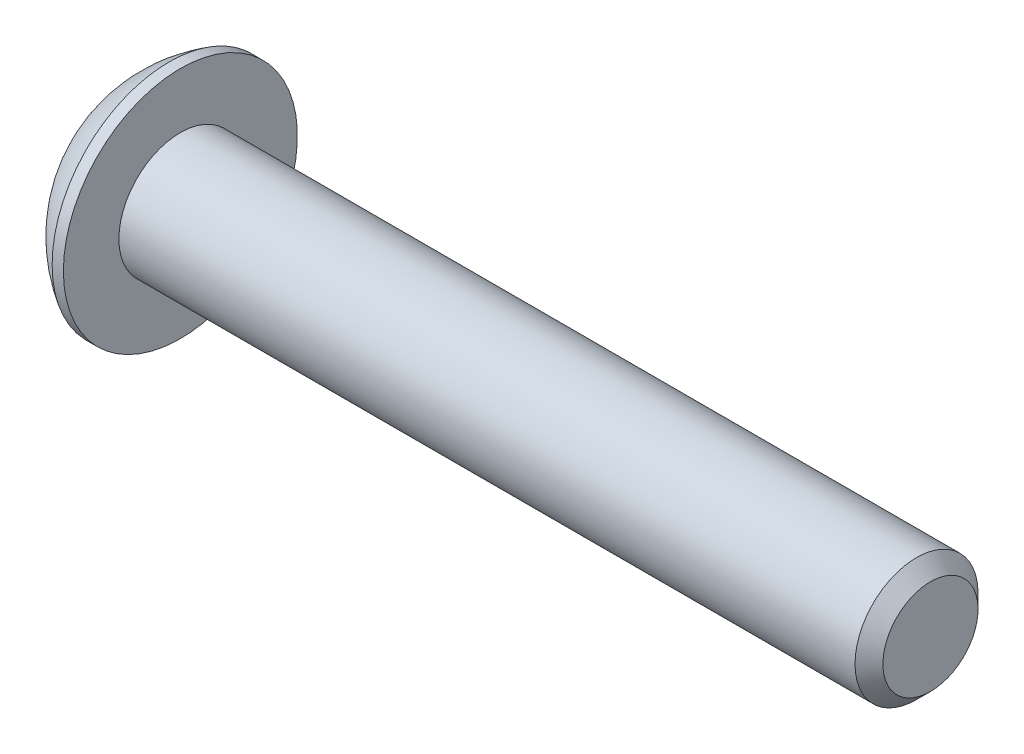
ISO-10303-21;
HEADER;
FILE_DESCRIPTION(('STEP AP214'),'2;1');
FILE_NAME('part.step','',(''),(''),'','','');
FILE_SCHEMA(('AUTOMOTIVE_DESIGN { 1 0 10303 214 1 1 1 1 }'));
ENDSEC;
DATA;
#1=APPLICATION_CONTEXT('core data for automotive mechanical design processes');
#2=APPLICATION_PROTOCOL_DEFINITION('international standard','automotive_design',2000,#1);
#3=PRODUCT_CONTEXT('',#1,'mechanical');
#4=PRODUCT('Part','Part','',(#3));
#5=PRODUCT_RELATED_PRODUCT_CATEGORY('part','',(#4));
#6=PRODUCT_DEFINITION_FORMATION('','',#4);
#7=PRODUCT_DEFINITION_CONTEXT('part definition',#1,'design');
#8=PRODUCT_DEFINITION('design','',#6,#7);
#9=PRODUCT_DEFINITION_SHAPE('','',#8);
#10=(LENGTH_UNIT() NAMED_UNIT(*) SI_UNIT(.MILLI.,.METRE.));
#11=(NAMED_UNIT(*) PLANE_ANGLE_UNIT() SI_UNIT($,.RADIAN.));
#12=(NAMED_UNIT(*) SI_UNIT($,.STERADIAN.) SOLID_ANGLE_UNIT());
#13=UNCERTAINTY_MEASURE_WITH_UNIT(LENGTH_MEASURE(1.E-05),#10,'distance_accuracy_value','');
#14=(GEOMETRIC_REPRESENTATION_CONTEXT(3) GLOBAL_UNCERTAINTY_ASSIGNED_CONTEXT((#13)) GLOBAL_UNIT_ASSIGNED_CONTEXT((#10,
#11,#12)) REPRESENTATION_CONTEXT('',''));
#15=CARTESIAN_POINT('',(0.,0.,0.));
#16=DIRECTION('',(0.,0.,1.));
#17=DIRECTION('',(1.,0.,0.));
#18=AXIS2_PLACEMENT_3D('',#15,#16,#17);
#19=CARTESIAN_POINT('',(1.32080000000034,0.,0.));
#20=DIRECTION('',(-1.,0.,0.));
#21=DIRECTION('',(0.,0.,1.));
#22=AXIS2_PLACEMENT_3D('',#19,#20,#21);
#23=CONICAL_SURFACE('',#22,1.1937999999998,1.04719755119608);
#24=CARTESIAN_POINT('',(2.01004075135902,0.,4.44089209850063E-13));
#25=VERTEX_POINT('',#24);
#26=VERTEX_LOOP('',#25);
#27=FACE_BOUND('',#26,.T.);
#28=CARTESIAN_POINT('',(1.32080000000009,0.,0.));
#29=DIRECTION('',(-1.,0.,0.));
#30=DIRECTION('',(0.,0.,1.));
#31=AXIS2_PLACEMENT_3D('',#28,#29,#30);
#32=CIRCLE('',#31,1.19380000000024);
#33=CARTESIAN_POINT('',(1.32080000000004,-1.03386112703797,0.59690000000006));
#34=VERTEX_POINT('',#33);
#35=CARTESIAN_POINT('',(1.32080000000004,0.,1.19380000000012));
#36=VERTEX_POINT('',#35);
#37=EDGE_CURVE('E18',#34,#36,#32,.T.);
#38=ORIENTED_EDGE('',*,*,#37,.T.);
#39=CARTESIAN_POINT('',(1.32080000000009,0.,0.));
#40=DIRECTION('',(-1.,0.,0.));
#41=DIRECTION('',(0.,0.,1.));
#42=AXIS2_PLACEMENT_3D('',#39,#40,#41);
#43=CIRCLE('',#42,1.19380000000024);
#44=CARTESIAN_POINT('',(1.32080000000004,1.03386112703797,0.596900000000061));
#45=VERTEX_POINT('',#44);
#46=EDGE_CURVE('E139',#36,#45,#43,.T.);
#47=ORIENTED_EDGE('',*,*,#46,.T.);
#48=CARTESIAN_POINT('',(1.32080000000009,0.,0.));
#49=DIRECTION('',(-1.,0.,0.));
#50=DIRECTION('',(0.,0.,1.));
#51=AXIS2_PLACEMENT_3D('',#48,#49,#50);
#52=CIRCLE('',#51,1.19380000000024);
#53=CARTESIAN_POINT('',(1.32080000000004,1.03386112703797,-0.596900000000061));
#54=VERTEX_POINT('',#53);
#55=EDGE_CURVE('E368',#45,#54,#52,.T.);
#56=ORIENTED_EDGE('',*,*,#55,.T.);
#57=CARTESIAN_POINT('',(1.32080000000009,0.,0.));
#58=DIRECTION('',(-1.,0.,0.));
#59=DIRECTION('',(0.,0.,1.));
#60=AXIS2_PLACEMENT_3D('',#57,#58,#59);
#61=CIRCLE('',#60,1.19380000000024);
#62=CARTESIAN_POINT('',(1.32080000000004,1.49457637585666E-12,-1.19380000000012));
#63=VERTEX_POINT('',#62);
#64=EDGE_CURVE('E366',#54,#63,#61,.T.);
#65=ORIENTED_EDGE('',*,*,#64,.T.);
#66=CARTESIAN_POINT('',(1.32080000000009,0.,0.));
#67=DIRECTION('',(-1.,0.,0.));
#68=DIRECTION('',(0.,0.,1.));
#69=AXIS2_PLACEMENT_3D('',#66,#67,#68);
#70=CIRCLE('',#69,1.19380000000024);
#71=CARTESIAN_POINT('',(1.32080000000004,-1.03386112703797,-0.59690000000006));
#72=VERTEX_POINT('',#71);
#73=EDGE_CURVE('E91',#63,#72,#70,.T.);
#74=ORIENTED_EDGE('',*,*,#73,.T.);
#75=CARTESIAN_POINT('',(1.32080000000009,0.,0.));
#76=DIRECTION('',(-1.,0.,0.));
#77=DIRECTION('',(0.,0.,1.));
#78=AXIS2_PLACEMENT_3D('',#75,#76,#77);
#79=CIRCLE('',#78,1.19380000000024);
#80=EDGE_CURVE('E87',#72,#34,#79,.T.);
#81=ORIENTED_EDGE('',*,*,#80,.T.);
#82=EDGE_LOOP('',(#38,#47,#56,#65,#74,#81));
#83=FACE_BOUND('',#82,.T.);
#84=ADVANCED_FACE('F14',(#27,#83),#23,.F.);
#85=CARTESIAN_POINT('',(1.3208,-2.06772225407572,-1.1938));
#86=DIRECTION('',(1.,0.,0.));
#87=DIRECTION('',(0.,0.,-1.));
#88=AXIS2_PLACEMENT_3D('',#85,#86,#87);
#89=PLANE('',#88);
#90=DIRECTION('',(0.,0.5,0.866025403784439));
#91=VECTOR('',#90,1.);
#92=CARTESIAN_POINT('',(1.3208,-1.37848150271715,0.));
#93=LINE('',#92,#91);
#94=CARTESIAN_POINT('',(1.3208,-0.689240751358574,1.1938));
#95=VERTEX_POINT('',#94);
#96=EDGE_CURVE('E99',#95,#34,#93,.F.);
#97=ORIENTED_EDGE('',*,*,#96,.F.);
#98=DIRECTION('',(0.,1.,0.));
#99=VECTOR('',#98,1.);
#100=CARTESIAN_POINT('',(1.3208,-0.689240751358574,1.1938));
#101=LINE('',#100,#99);
#102=EDGE_CURVE('E101',#36,#95,#101,.F.);
#103=ORIENTED_EDGE('',*,*,#102,.F.);
#104=ORIENTED_EDGE('',*,*,#37,.F.);
#105=EDGE_LOOP('',(#97,#103,#104));
#106=FACE_BOUND('',#105,.T.);
#107=ADVANCED_FACE('F97',(#106),#89,.F.);
#108=CARTESIAN_POINT('',(1.3208,-2.06772225407572,-1.1938));
#109=DIRECTION('',(1.,0.,0.));
#110=DIRECTION('',(0.,0.,-1.));
#111=AXIS2_PLACEMENT_3D('',#108,#109,#110);
#112=PLANE('',#111);
#113=DIRECTION('',(0.,-0.5,0.866025403784439));
#114=VECTOR('',#113,1.);
#115=CARTESIAN_POINT('',(1.3208,-0.689240751358574,-1.1938));
#116=LINE('',#115,#114);
#117=CARTESIAN_POINT('',(1.3208,-1.37848150271715,0.));
#118=VERTEX_POINT('',#117);
#119=EDGE_CURVE('E107',#118,#72,#116,.F.);
#120=ORIENTED_EDGE('',*,*,#119,.F.);
#121=DIRECTION('',(0.,0.5,0.866025403784439));
#122=VECTOR('',#121,1.);
#123=CARTESIAN_POINT('',(1.3208,-1.37848150271715,0.));
#124=LINE('',#123,#122);
#125=EDGE_CURVE('E104',#34,#118,#124,.F.);
#126=ORIENTED_EDGE('',*,*,#125,.F.);
#127=ORIENTED_EDGE('',*,*,#80,.F.);
#128=EDGE_LOOP('',(#120,#126,#127));
#129=FACE_BOUND('',#128,.T.);
#130=ADVANCED_FACE('F105',(#129),#112,.F.);
#131=CARTESIAN_POINT('',(1.3208,-2.06772225407572,-1.1938));
#132=DIRECTION('',(1.,0.,0.));
#133=DIRECTION('',(0.,0.,-1.));
#134=AXIS2_PLACEMENT_3D('',#131,#132,#133);
#135=PLANE('',#134);
#136=DIRECTION('',(0.,1.,0.));
#137=VECTOR('',#136,1.);
#138=CARTESIAN_POINT('',(1.3208,0.689240751358577,-1.1938));
#139=LINE('',#138,#137);
#140=CARTESIAN_POINT('',(1.3208,-0.689240751358574,-1.1938));
#141=VERTEX_POINT('',#140);
#142=EDGE_CURVE('E336',#141,#63,#139,.T.);
#143=ORIENTED_EDGE('',*,*,#142,.F.);
#144=DIRECTION('',(0.,-0.5,0.866025403784439));
#145=VECTOR('',#144,1.);
#146=CARTESIAN_POINT('',(1.3208,-0.689240751358574,-1.1938));
#147=LINE('',#146,#145);
#148=EDGE_CURVE('E341',#72,#141,#147,.F.);
#149=ORIENTED_EDGE('',*,*,#148,.F.);
#150=ORIENTED_EDGE('',*,*,#73,.F.);
#151=EDGE_LOOP('',(#143,#149,#150));
#152=FACE_BOUND('',#151,.T.);
#153=ADVANCED_FACE('F182',(#152),#135,.F.);
#154=CARTESIAN_POINT('',(1.3208,-2.06772225407572,-1.1938));
#155=DIRECTION('',(1.,0.,0.));
#156=DIRECTION('',(0.,0.,-1.));
#157=AXIS2_PLACEMENT_3D('',#154,#155,#156);
#158=PLANE('',#157);
#159=DIRECTION('',(0.,-0.5,-0.866025403784439));
#160=VECTOR('',#159,1.);
#161=CARTESIAN_POINT('',(1.3208,1.37848150271715,0.));
#162=LINE('',#161,#160);
#163=CARTESIAN_POINT('',(1.3208,0.689240751358577,-1.1938));
#164=VERTEX_POINT('',#163);
#165=EDGE_CURVE('E327',#164,#54,#162,.F.);
#166=ORIENTED_EDGE('',*,*,#165,.F.);
#167=DIRECTION('',(0.,1.,0.));
#168=VECTOR('',#167,1.);
#169=CARTESIAN_POINT('',(1.3208,0.689240751358577,-1.1938));
#170=LINE('',#169,#168);
#171=EDGE_CURVE('E333',#63,#164,#170,.T.);
#172=ORIENTED_EDGE('',*,*,#171,.F.);
#173=ORIENTED_EDGE('',*,*,#64,.F.);
#174=EDGE_LOOP('',(#166,#172,#173));
#175=FACE_BOUND('',#174,.T.);
#176=ADVANCED_FACE('F178',(#175),#158,.F.);
#177=CARTESIAN_POINT('',(1.3208,-2.06772225407572,-1.1938));
#178=DIRECTION('',(1.,0.,0.));
#179=DIRECTION('',(0.,0.,-1.));
#180=AXIS2_PLACEMENT_3D('',#177,#178,#179);
#181=PLANE('',#180);
#182=DIRECTION('',(0.,0.5,-0.866025403784439));
#183=VECTOR('',#182,1.);
#184=CARTESIAN_POINT('',(1.3208,0.689240751358576,1.1938));
#185=LINE('',#184,#183);
#186=CARTESIAN_POINT('',(1.3208,1.37848150271715,0.));
#187=VERTEX_POINT('',#186);
#188=EDGE_CURVE('E314',#187,#45,#185,.F.);
#189=ORIENTED_EDGE('',*,*,#188,.F.);
#190=DIRECTION('',(0.,-0.5,-0.866025403784439));
#191=VECTOR('',#190,1.);
#192=CARTESIAN_POINT('',(1.3208,1.37848150271715,0.));
#193=LINE('',#192,#191);
#194=EDGE_CURVE('E325',#54,#187,#193,.F.);
#195=ORIENTED_EDGE('',*,*,#194,.F.);
#196=ORIENTED_EDGE('',*,*,#55,.F.);
#197=EDGE_LOOP('',(#189,#195,#196));
#198=FACE_BOUND('',#197,.T.);
#199=ADVANCED_FACE('F174',(#198),#181,.F.);
#200=CARTESIAN_POINT('',(1.3208,-2.06772225407572,-1.1938));
#201=DIRECTION('',(1.,0.,0.));
#202=DIRECTION('',(0.,0.,-1.));
#203=AXIS2_PLACEMENT_3D('',#200,#201,#202);
#204=PLANE('',#203);
#205=DIRECTION('',(0.,1.,0.));
#206=VECTOR('',#205,1.);
#207=CARTESIAN_POINT('',(1.3208,-0.689240751358574,1.1938));
#208=LINE('',#207,#206);
#209=CARTESIAN_POINT('',(1.3208,0.689240751358576,1.1938));
#210=VERTEX_POINT('',#209);
#211=EDGE_CURVE('E116',#210,#36,#208,.F.);
#212=ORIENTED_EDGE('',*,*,#211,.F.);
#213=DIRECTION('',(0.,0.5,-0.866025403784439));
#214=VECTOR('',#213,1.);
#215=CARTESIAN_POINT('',(1.3208,0.689240751358576,1.1938));
#216=LINE('',#215,#214);
#217=EDGE_CURVE('E317',#45,#210,#216,.F.);
#218=ORIENTED_EDGE('',*,*,#217,.F.);
#219=ORIENTED_EDGE('',*,*,#46,.F.);
#220=EDGE_LOOP('',(#212,#218,#219));
#221=FACE_BOUND('',#220,.T.);
#222=ADVANCED_FACE('F170',(#221),#204,.F.);
#223=CARTESIAN_POINT('',(1.3208,-0.689240751358574,1.1938));
#224=DIRECTION('',(0.,0.,-1.));
#225=DIRECTION('',(0.,1.,0.));
#226=AXIS2_PLACEMENT_3D('',#223,#224,#225);
#227=PLANE('',#226);
#228=DIRECTION('',(0.,1.,0.));
#229=VECTOR('',#228,1.);
#230=CARTESIAN_POINT('',(0.,0.,1.1938));
#231=LINE('',#230,#229);
#232=CARTESIAN_POINT('',(0.,0.689240751358577,1.1938));
#233=VERTEX_POINT('',#232);
#234=CARTESIAN_POINT('',(0.,-0.689240751358574,1.1938));
#235=VERTEX_POINT('',#234);
#236=EDGE_CURVE('E329',#233,#235,#231,.F.);
#237=ORIENTED_EDGE('',*,*,#236,.F.);
#238=DIRECTION('',(1.,0.,0.));
#239=VECTOR('',#238,1.);
#240=CARTESIAN_POINT('',(1.3208,0.689240751358576,1.1938));
#241=LINE('',#240,#239);
#242=EDGE_CURVE('E321',#210,#233,#241,.F.);
#243=ORIENTED_EDGE('',*,*,#242,.F.);
#244=ORIENTED_EDGE('',*,*,#211,.T.);
#245=ORIENTED_EDGE('',*,*,#102,.T.);
#246=DIRECTION('',(1.,0.,0.));
#247=VECTOR('',#246,1.);
#248=CARTESIAN_POINT('',(1.3208,-0.689240751358574,1.1938));
#249=LINE('',#248,#247);
#250=EDGE_CURVE('E110',#235,#95,#249,.T.);
#251=ORIENTED_EDGE('',*,*,#250,.F.);
#252=EDGE_LOOP('',(#237,#243,#244,#245,#251));
#253=FACE_BOUND('',#252,.T.);
#254=ADVANCED_FACE('F167',(#253),#227,.T.);
#255=CARTESIAN_POINT('',(1.3208,-1.37848150271715,0.));
#256=DIRECTION('',(0.,0.866025403784439,-0.5));
#257=DIRECTION('',(0.,0.5,0.866025403784439));
#258=AXIS2_PLACEMENT_3D('',#255,#256,#257);
#259=PLANE('',#258);
#260=DIRECTION('',(0.,-0.5,-0.866025403784439));
#261=VECTOR('',#260,1.);
#262=CARTESIAN_POINT('',(0.,-0.689240751358574,1.1938));
#263=LINE('',#262,#261);
#264=CARTESIAN_POINT('',(0.,-1.37848150271715,0.));
#265=VERTEX_POINT('',#264);
#266=EDGE_CURVE('E350',#235,#265,#263,.T.);
#267=ORIENTED_EDGE('',*,*,#266,.F.);
#268=ORIENTED_EDGE('',*,*,#250,.T.);
#269=ORIENTED_EDGE('',*,*,#96,.T.);
#270=ORIENTED_EDGE('',*,*,#125,.T.);
#271=DIRECTION('',(1.,0.,0.));
#272=VECTOR('',#271,1.);
#273=CARTESIAN_POINT('',(1.3208,-1.37848150271715,0.));
#274=LINE('',#273,#272);
#275=EDGE_CURVE('E119',#265,#118,#274,.T.);
#276=ORIENTED_EDGE('',*,*,#275,.F.);
#277=EDGE_LOOP('',(#267,#268,#269,#270,#276));
#278=FACE_BOUND('',#277,.T.);
#279=ADVANCED_FACE('F114',(#278),#259,.T.);
#280=CARTESIAN_POINT('',(1.3208,-0.689240751358574,-1.1938));
#281=DIRECTION('',(0.,0.866025403784439,0.5));
#282=DIRECTION('',(0.,-0.5,0.866025403784439));
#283=AXIS2_PLACEMENT_3D('',#280,#281,#282);
#284=PLANE('',#283);
#285=DIRECTION('',(0.,0.5,-0.866025403784439));
#286=VECTOR('',#285,1.);
#287=CARTESIAN_POINT('',(0.,-1.37848150271715,0.));
#288=LINE('',#287,#286);
#289=CARTESIAN_POINT('',(0.,-0.689240751358574,-1.1938));
#290=VERTEX_POINT('',#289);
#291=EDGE_CURVE('E348',#265,#290,#288,.T.);
#292=ORIENTED_EDGE('',*,*,#291,.F.);
#293=ORIENTED_EDGE('',*,*,#275,.T.);
#294=ORIENTED_EDGE('',*,*,#119,.T.);
#295=ORIENTED_EDGE('',*,*,#148,.T.);
#296=DIRECTION('',(1.,0.,0.));
#297=VECTOR('',#296,1.);
#298=CARTESIAN_POINT('',(1.3208,-0.689240751358574,-1.1938));
#299=LINE('',#298,#297);
#300=EDGE_CURVE('E332',#290,#141,#299,.T.);
#301=ORIENTED_EDGE('',*,*,#300,.F.);
#302=EDGE_LOOP('',(#292,#293,#294,#295,#301));
#303=FACE_BOUND('',#302,.T.);
#304=ADVANCED_FACE('F160',(#303),#284,.T.);
#305=CARTESIAN_POINT('',(1.3208,0.689240751358577,-1.1938));
#306=DIRECTION('',(0.,0.,1.));
#307=DIRECTION('',(1.,0.,0.));
#308=AXIS2_PLACEMENT_3D('',#305,#306,#307);
#309=PLANE('',#308);
#310=DIRECTION('',(0.,1.,0.));
#311=VECTOR('',#310,1.);
#312=CARTESIAN_POINT('',(0.,0.,-1.1938));
#313=LINE('',#312,#311);
#314=CARTESIAN_POINT('',(0.,0.689240751358577,-1.1938));
#315=VERTEX_POINT('',#314);
#316=EDGE_CURVE('E358',#290,#315,#313,.T.);
#317=ORIENTED_EDGE('',*,*,#316,.F.);
#318=ORIENTED_EDGE('',*,*,#300,.T.);
#319=ORIENTED_EDGE('',*,*,#142,.T.);
#320=ORIENTED_EDGE('',*,*,#171,.T.);
#321=DIRECTION('',(1.,0.,0.));
#322=VECTOR('',#321,1.);
#323=CARTESIAN_POINT('',(1.3208,0.689240751358577,-1.1938));
#324=LINE('',#323,#322);
#325=EDGE_CURVE('E318',#315,#164,#324,.T.);
#326=ORIENTED_EDGE('',*,*,#325,.F.);
#327=EDGE_LOOP('',(#317,#318,#319,#320,#326));
#328=FACE_BOUND('',#327,.T.);
#329=ADVANCED_FACE('F157',(#328),#309,.T.);
#330=CARTESIAN_POINT('',(1.3208,1.37848150271715,0.));
#331=DIRECTION('',(0.,-0.866025403784439,0.5));
#332=DIRECTION('',(0.,-0.5,-0.866025403784439));
#333=AXIS2_PLACEMENT_3D('',#330,#331,#332);
#334=PLANE('',#333);
#335=DIRECTION('',(0.,0.5,0.866025403784439));
#336=VECTOR('',#335,1.);
#337=CARTESIAN_POINT('',(0.,0.689240751358577,-1.1938));
#338=LINE('',#337,#336);
#339=CARTESIAN_POINT('',(0.,1.37848150271715,0.));
#340=VERTEX_POINT('',#339);
#341=EDGE_CURVE('E361',#315,#340,#338,.T.);
#342=ORIENTED_EDGE('',*,*,#341,.F.);
#343=ORIENTED_EDGE('',*,*,#325,.T.);
#344=ORIENTED_EDGE('',*,*,#165,.T.);
#345=ORIENTED_EDGE('',*,*,#194,.T.);
#346=DIRECTION('',(1.,0.,0.));
#347=VECTOR('',#346,1.);
#348=CARTESIAN_POINT('',(1.3208,1.37848150271715,0.));
#349=LINE('',#348,#347);
#350=EDGE_CURVE('E33',#340,#187,#349,.T.);
#351=ORIENTED_EDGE('',*,*,#350,.F.);
#352=EDGE_LOOP('',(#342,#343,#344,#345,#351));
#353=FACE_BOUND('',#352,.T.);
#354=ADVANCED_FACE('F153',(#353),#334,.T.);
#355=CARTESIAN_POINT('',(1.3208,0.689240751358576,1.1938));
#356=DIRECTION('',(0.,-0.866025403784439,-0.5));
#357=DIRECTION('',(0.,0.5,-0.866025403784439));
#358=AXIS2_PLACEMENT_3D('',#355,#356,#357);
#359=PLANE('',#358);
#360=DIRECTION('',(0.,-0.5,0.866025403784439));
#361=VECTOR('',#360,1.);
#362=CARTESIAN_POINT('',(0.,1.37848150271715,0.));
#363=LINE('',#362,#361);
#364=EDGE_CURVE('E138',#340,#233,#363,.T.);
#365=ORIENTED_EDGE('',*,*,#364,.F.);
#366=ORIENTED_EDGE('',*,*,#350,.T.);
#367=ORIENTED_EDGE('',*,*,#188,.T.);
#368=ORIENTED_EDGE('',*,*,#217,.T.);
#369=ORIENTED_EDGE('',*,*,#242,.T.);
#370=EDGE_LOOP('',(#365,#366,#367,#368,#369));
#371=FACE_BOUND('',#370,.T.);
#372=ADVANCED_FACE('F149',(#371),#359,.T.);
#373=CARTESIAN_POINT('',(0.,0.,0.));
#374=DIRECTION('',(-1.,0.,0.));
#375=DIRECTION('',(0.,0.,1.));
#376=AXIS2_PLACEMENT_3D('',#373,#374,#375);
#377=PLANE('',#376);
#378=ORIENTED_EDGE('',*,*,#341,.T.);
#379=ORIENTED_EDGE('',*,*,#364,.T.);
#380=ORIENTED_EDGE('',*,*,#236,.T.);
#381=ORIENTED_EDGE('',*,*,#266,.T.);
#382=ORIENTED_EDGE('',*,*,#291,.T.);
#383=ORIENTED_EDGE('',*,*,#316,.T.);
#384=EDGE_LOOP('',(#378,#379,#380,#381,#382,#383));
#385=FACE_BOUND('',#384,.T.);
#386=CARTESIAN_POINT('',(0.,1.9812,0.));
#387=CARTESIAN_POINT('',(0.,1.9811996664299,0.0556258831179429));
#388=CARTESIAN_POINT('',(0.,1.97885520380442,0.111261989398606));
#389=CARTESIAN_POINT('',(0.,1.96949260169541,0.222149719830458));
#390=CARTESIAN_POINT('',(0.,1.96247308239606,0.277401225602896));
#391=CARTESIAN_POINT('',(0.,1.94379192841039,0.387209508139748));
#392=CARTESIAN_POINT('',(-1.85322098412163E-13,1.93212292489526,0.441765039546366));
#393=CARTESIAN_POINT('',(1.86340516395781E-13,1.90422331175315,0.549729449347493));
#394=CARTESIAN_POINT('',(6.9454338814387E-13,1.88798900035338,0.603137359208869));
#395=CARTESIAN_POINT('',(1.15501971975443E-12,1.832662144765,0.760839131321828));
#396=CARTESIAN_POINT('',(0.,1.78690023648845,0.86287643357543));
#397=CARTESIAN_POINT('',(0.,1.67887358150667,1.05780719540872));
#398=CARTESIAN_POINT('',(9.54252846156157E-13,1.6166082074585,1.15070030720801));
#399=CARTESIAN_POINT('',(5.94775737193293E-13,1.51224157140982,1.28116890915698));
#400=CARTESIAN_POINT('',(1.63135429314554E-13,1.47559703943539,1.32320451127027));
#401=CARTESIAN_POINT('',(-1.62111198585679E-13,1.39893832619713,1.40400288695709));
#402=CARTESIAN_POINT('',(0.,1.35892742784698,1.44276877695455));
#403=CARTESIAN_POINT('',(1.13736409396491E-13,1.23416504602197,1.55382272417904));
#404=CARTESIAN_POINT('',(0.,1.14466125559859,1.62089527952111));
#405=CARTESIAN_POINT('',(0.,0.955712144178161,1.73902218081179));
#406=CARTESIAN_POINT('',(0.,0.856267198233561,1.79007713076008));
#407=CARTESIAN_POINT('',(0.,0.65020634591084,1.87477637530954));
#408=CARTESIAN_POINT('',(0.,0.543590516134851,1.90842085586266));
#409=CARTESIAN_POINT('',(0.,0.326226155292014,1.95733039300656));
#410=CARTESIAN_POINT('',(0.,0.215477602157926,1.97259535144288));
#411=CARTESIAN_POINT('',(0.,-0.00701040587545002,1.98431697865418));
#412=CARTESIAN_POINT('',(0.,-0.118749860774737,1.98077364742916));
#413=CARTESIAN_POINT('',(0.,-0.340050178355489,1.95497485623824));
#414=CARTESIAN_POINT('',(0.,-0.449611052668259,1.93271949620217));
#415=CARTESIAN_POINT('',(0.,-0.663431110729177,1.87014138774524));
#416=CARTESIAN_POINT('',(0.,-0.767690237838523,1.82981844635272));
#417=CARTESIAN_POINT('',(0.,-0.968005760719348,1.73219968377096));
#418=CARTESIAN_POINT('',(0.,-1.0640618469811,1.6749032225164));
#419=CARTESIAN_POINT('',(0.,-1.19980276751283,1.57757371205873));
#420=CARTESIAN_POINT('',(0.,-1.24366557129214,1.54322665019466));
#421=CARTESIAN_POINT('',(0.,-1.32838995706696,1.47093063174264));
#422=CARTESIAN_POINT('',(0.,-1.36924860178706,1.43297823102439));
#423=CARTESIAN_POINT('',(0.,-1.48674671849223,1.31419842051172));
#424=CARTESIAN_POINT('',(0.,-1.55842832343237,1.22836221289311));
#425=CARTESIAN_POINT('',(0.,-1.6863396856475,1.04586168272493));
#426=CARTESIAN_POINT('',(0.,-1.7425700302488,0.949197771949769));
#427=CARTESIAN_POINT('',(0.,-1.8141614250401,0.798182600298679));
#428=CARTESIAN_POINT('',(0.,-1.83591780585875,0.746776203847787));
#429=CARTESIAN_POINT('',(0.,-1.87500754181092,0.642341081688632));
#430=CARTESIAN_POINT('',(0.,-1.89234447645404,0.589313708122843));
#431=CARTESIAN_POINT('',(0.,-1.92246053433555,0.482076273028391));
#432=CARTESIAN_POINT('',(0.,-1.93524685475118,0.427868224257506));
#433=CARTESIAN_POINT('',(0.,-1.95620937250494,0.318578151844607));
#434=CARTESIAN_POINT('',(0.,-1.96438692958147,0.263496390912868));
#435=CARTESIAN_POINT('',(0.,-1.97388528284653,0.173607715038555));
#436=CARTESIAN_POINT('',(0.,-1.97662743364426,0.138944718024995));
#437=CARTESIAN_POINT('',(0.,-1.98028489645283,0.069522478256699));
#438=CARTESIAN_POINT('',(0.,-1.98120020846367,0.0347632355019625));
#439=CARTESIAN_POINT('',(0.,-1.9811996664299,-0.0556258831179437));
#440=CARTESIAN_POINT('',(0.,-1.97885520380442,-0.111261989398607));
#441=CARTESIAN_POINT('',(0.,-1.96949260169541,-0.222149719830459));
#442=CARTESIAN_POINT('',(0.,-1.96247308239605,-0.277401225602897));
#443=CARTESIAN_POINT('',(0.,-1.94379192841039,-0.387209508139749));
#444=CARTESIAN_POINT('',(-1.85273829369933E-13,-1.93212292489526,-0.441765039546367));
#445=CARTESIAN_POINT('',(1.86292208101257E-13,-1.90422331175315,-0.549729449347495));
#446=CARTESIAN_POINT('',(6.94526512411752E-13,-1.88798900035338,-0.603137359208872));
#447=CARTESIAN_POINT('',(1.15505339077404E-12,-1.83266214476501,-0.760839131321831));
#448=CARTESIAN_POINT('',(0.,-1.78690023648846,-0.862876433575432));
#449=CARTESIAN_POINT('',(0.,-1.67887358150667,-1.05780719540872));
#450=CARTESIAN_POINT('',(9.54248949793369E-13,-1.6166082074585,-1.15070030720801));
#451=CARTESIAN_POINT('',(5.94777687927534E-13,-1.51224157140982,-1.28116890915698));
#452=CARTESIAN_POINT('',(1.63138929838936E-13,-1.4755970394354,-1.32320451127027));
#453=CARTESIAN_POINT('',(-1.62114695735028E-13,-1.39893832619713,-1.40400288695709));
#454=CARTESIAN_POINT('',(0.,-1.35892742784699,-1.44276877695455));
#455=CARTESIAN_POINT('',(1.13760471433616E-13,-1.23416504602197,-1.55382272417904));
#456=CARTESIAN_POINT('',(0.,-1.14466125559859,-1.62089527952111));
#457=CARTESIAN_POINT('',(0.,-0.95571214417816,-1.73902218081179));
#458=CARTESIAN_POINT('',(0.,-0.856267198233559,-1.79007713076007));
#459=CARTESIAN_POINT('',(0.,-0.650206345910841,-1.87477637530954));
#460=CARTESIAN_POINT('',(0.,-0.543590516134854,-1.90842085586267));
#461=CARTESIAN_POINT('',(0.,-0.326226155292018,-1.95733039300657));
#462=CARTESIAN_POINT('',(0.,-0.215477602157928,-1.97259535144288));
#463=CARTESIAN_POINT('',(0.,0.00701040587544881,-1.98431697865418));
#464=CARTESIAN_POINT('',(0.,0.118749860774737,-1.98077364742916));
#465=CARTESIAN_POINT('',(0.,0.340050178355489,-1.95497485623824));
#466=CARTESIAN_POINT('',(0.,0.44961105266826,-1.93271949620218));
#467=CARTESIAN_POINT('',(0.,0.663431110729178,-1.87014138774524));
#468=CARTESIAN_POINT('',(0.,0.767690237838524,-1.82981844635272));
#469=CARTESIAN_POINT('',(0.,0.968005760719347,-1.73219968377096));
#470=CARTESIAN_POINT('',(0.,1.0640618469811,-1.67490322251639));
#471=CARTESIAN_POINT('',(0.,1.19980276751283,-1.57757371205873));
#472=CARTESIAN_POINT('',(0.,1.24366557129214,-1.54322665019465));
#473=CARTESIAN_POINT('',(0.,1.32838995706696,-1.47093063174263));
#474=CARTESIAN_POINT('',(0.,1.36924860178706,-1.43297823102439));
#475=CARTESIAN_POINT('',(0.,1.48674671849223,-1.31419842051172));
#476=CARTESIAN_POINT('',(0.,1.55842832343237,-1.22836221289311));
#477=CARTESIAN_POINT('',(0.,1.6863396856475,-1.04586168272493));
#478=CARTESIAN_POINT('',(0.,1.7425700302488,-0.94919777194977));
#479=CARTESIAN_POINT('',(0.,1.8141614250401,-0.798182600298679));
#480=CARTESIAN_POINT('',(0.,1.83591780585875,-0.746776203847786));
#481=CARTESIAN_POINT('',(0.,1.87500754181092,-0.642341081688631));
#482=CARTESIAN_POINT('',(0.,1.89234447645404,-0.589313708122842));
#483=CARTESIAN_POINT('',(0.,1.92246053433555,-0.482076273028391));
#484=CARTESIAN_POINT('',(0.,1.93524685475118,-0.427868224257506));
#485=CARTESIAN_POINT('',(0.,1.95620937250494,-0.318578151844607));
#486=CARTESIAN_POINT('',(0.,1.96438692958147,-0.263496390912867));
#487=CARTESIAN_POINT('',(0.,1.97388528284653,-0.173607715038554));
#488=CARTESIAN_POINT('',(0.,1.97662743364426,-0.138944718024995));
#489=CARTESIAN_POINT('',(0.,1.98028489645283,-0.0695224782566994));
#490=CARTESIAN_POINT('',(0.,1.98120020846367,-0.0347632355019633));
#491=CARTESIAN_POINT('',(0.,1.9812,0.));
#492=B_SPLINE_CURVE_WITH_KNOTS('',3,(#386,#387,#388,#389,#390,#391,#392,#393,#394,#395,#396,
#397,#398,#399,#400,#401,#402,#403,#404,#405,#406,#407,#408,#409,#410,#411,#412,#413,#414,#415,
#416,#417,#418,#419,#420,#421,#422,#423,#424,#425,#426,#427,#428,#429,#430,#431,#432,#433,#434,
#435,#436,#437,#438,#439,#440,#441,#442,#443,#444,#445,#446,#447,#448,#449,#450,#451,#452,#453,
#454,#455,#456,#457,#458,#459,#460,#461,#462,#463,#464,#465,#466,#467,#468,#469,#470,#471,#472,
#473,#474,#475,#476,#477,#478,#479,#480,#481,#482,#483,#484,#485,#486,#487,#488,#489,#490,#491),
.UNSPECIFIED.,.T.,.F.,(4,2,2,2,2,2,2,2,2,2,2,2,2,2,2,2,2,2,2,2,2,2,2,2,2,2,2,2,2,2,2,2,2,2,2,2,
2,2,2,2,2,2,2,2,2,2,2,2,2,2,2,2,4),(0.,0.166845646007828,0.333740557374256,0.500901034367694,
0.668197445942387,1.00199278686282,1.33580081809885,1.50292354032982,1.6698851310853,
2.00370118900129,2.33750465770544,2.67130456115909,3.00510624723801,3.33890793331696,
3.67270783677065,4.00651130547476,4.34032736339026,4.50728895414554,4.67441167637632,
5.0082197076126,5.34201504853333,5.50931146010827,5.67647193710192,5.84336684846844,
6.01021249447641,6.11448220058334,6.21875190669029,6.38559755269811,6.55249246406454,
6.71965294105798,6.88694935263267,7.22074469355311,7.55455272478914,7.72167544702011,
7.88863703777559,8.22245309569158,8.55625656439573,8.89005646784938,9.2238581539283,
9.55765984000725,9.89145974346094,10.225263212165,10.5590792700806,10.7260408608358,
10.8931635830666,11.2269716143029,11.5607669552236,11.7280633667986,11.8952238437922,
12.0621187551587,12.2289644011667,12.3332341072736,12.4375038133806),.UNSPECIFIED.);
#493=CARTESIAN_POINT('',(0.,1.9812,0.));
#494=VERTEX_POINT('',#493);
#495=EDGE_CURVE('E131',#494,#494,#492,.T.);
#496=ORIENTED_EDGE('',*,*,#495,.F.);
#497=EDGE_LOOP('',(#496));
#498=FACE_BOUND('',#497,.T.);
#499=ADVANCED_FACE('F145',(#385,#498),#377,.T.);
#500=CARTESIAN_POINT('',(4.13385,0.,0.));
#501=DIRECTION('',(0.,1.,0.));
#502=DIRECTION('',(1.,0.,0.));
#503=AXIS2_PLACEMENT_3D('',#500,#501,#502);
#504=SPHERICAL_SURFACE('',#503,4.58408870578439);
#505=CARTESIAN_POINT('',(1.8288,0.,0.));
#506=DIRECTION('',(-1.,0.,0.));
#507=DIRECTION('',(0.,0.,1.));
#508=AXIS2_PLACEMENT_3D('',#505,#506,#507);
#509=CIRCLE('',#508,3.9624);
#510=CARTESIAN_POINT('',(1.8288,0.,3.9624));
#511=VERTEX_POINT('',#510);
#512=EDGE_CURVE('E128',#511,#511,#509,.F.);
#513=ORIENTED_EDGE('',*,*,#512,.F.);
#514=EDGE_LOOP('',(#513));
#515=FACE_BOUND('',#514,.T.);
#516=ORIENTED_EDGE('',*,*,#495,.T.);
#517=EDGE_LOOP('',(#516));
#518=FACE_BOUND('',#517,.T.);
#519=ADVANCED_FACE('F141',(#515,#518),#504,.T.);
#520=CARTESIAN_POINT('',(27.6098,0.,0.));
#521=DIRECTION('',(-1.,0.,0.));
#522=DIRECTION('',(0.,0.,1.));
#523=AXIS2_PLACEMENT_3D('',#520,#521,#522);
#524=PLANE('',#523);
#525=CARTESIAN_POINT('',(27.6097999999365,0.,0.));
#526=DIRECTION('',(-1.,0.,0.));
#527=DIRECTION('',(0.,-1.,0.));
#528=AXIS2_PLACEMENT_3D('',#525,#526,#527);
#529=CIRCLE('',#528,1.61036000002923);
#530=CARTESIAN_POINT('',(27.6097999999365,-1.61036000002923,0.));
#531=VERTEX_POINT('',#530);
#532=EDGE_CURVE('E125',#531,#531,#529,.T.);
#533=ORIENTED_EDGE('',*,*,#532,.F.);
#534=EDGE_LOOP('',(#533));
#535=FACE_BOUND('',#534,.T.);
#536=ADVANCED_FACE('F213',(#535),#524,.F.);
#537=CARTESIAN_POINT('',(0.,0.,0.));
#538=DIRECTION('',(-1.,0.,0.));
#539=DIRECTION('',(0.,0.,1.));
#540=AXIS2_PLACEMENT_3D('',#537,#538,#539);
#541=CYLINDRICAL_SURFACE('',#540,3.9624);
#542=ORIENTED_EDGE('',*,*,#512,.T.);
#543=EDGE_LOOP('',(#542));
#544=FACE_BOUND('',#543,.T.);
#545=CARTESIAN_POINT('',(2.2098,0.,0.));
#546=DIRECTION('',(-1.,0.,0.));
#547=DIRECTION('',(0.,0.,1.));
#548=AXIS2_PLACEMENT_3D('',#545,#546,#547);
#549=CIRCLE('',#548,3.9624);
#550=CARTESIAN_POINT('',(2.2098,0.,3.9624));
#551=VERTEX_POINT('',#550);
#552=EDGE_CURVE('E122',#551,#551,#549,.T.);
#553=ORIENTED_EDGE('',*,*,#552,.T.);
#554=EDGE_LOOP('',(#553));
#555=FACE_BOUND('',#554,.T.);
#556=ADVANCED_FACE('F211',(#544,#555),#541,.T.);
#557=CARTESIAN_POINT('',(27.1373600000402,0.,0.));
#558=DIRECTION('',(-1.,0.,0.));
#559=DIRECTION('',(0.,-1.,0.));
#560=AXIS2_PLACEMENT_3D('',#557,#558,#559);
#561=CONICAL_SURFACE('',#560,2.08279999992556,0.785398163397448);
#562=ORIENTED_EDGE('',*,*,#532,.T.);
#563=EDGE_LOOP('',(#562));
#564=FACE_BOUND('',#563,.T.);
#565=CARTESIAN_POINT('',(27.13736,0.,0.));
#566=DIRECTION('',(-1.,0.,0.));
#567=DIRECTION('',(0.,0.,1.));
#568=AXIS2_PLACEMENT_3D('',#565,#566,#567);
#569=CIRCLE('',#568,2.0828);
#570=CARTESIAN_POINT('',(27.13736,0.,2.0828));
#571=VERTEX_POINT('',#570);
#572=EDGE_CURVE('E24',#571,#571,#569,.T.);
#573=ORIENTED_EDGE('',*,*,#572,.F.);
#574=EDGE_LOOP('',(#573));
#575=FACE_BOUND('',#574,.T.);
#576=ADVANCED_FACE('F202',(#564,#575),#561,.T.);
#577=CARTESIAN_POINT('',(2.2098,2.0828,0.));
#578=DIRECTION('',(-1.,0.,0.));
#579=DIRECTION('',(0.,0.,1.));
#580=AXIS2_PLACEMENT_3D('',#577,#578,#579);
#581=PLANE('',#580);
#582=CARTESIAN_POINT('',(2.2098,0.,0.));
#583=DIRECTION('',(-1.,0.,0.));
#584=DIRECTION('',(0.,0.,1.));
#585=AXIS2_PLACEMENT_3D('',#582,#583,#584);
#586=CIRCLE('',#585,2.0828);
#587=CARTESIAN_POINT('',(2.2098,0.,2.0828));
#588=VERTEX_POINT('',#587);
#589=EDGE_CURVE('E9',#588,#588,#586,.F.);
#590=ORIENTED_EDGE('',*,*,#589,.F.);
#591=EDGE_LOOP('',(#590));
#592=FACE_BOUND('',#591,.T.);
#593=ORIENTED_EDGE('',*,*,#552,.F.);
#594=EDGE_LOOP('',(#593));
#595=FACE_BOUND('',#594,.T.);
#596=ADVANCED_FACE('F197',(#592,#595),#581,.F.);
#597=CARTESIAN_POINT('',(0.,0.,0.));
#598=DIRECTION('',(-1.,0.,0.));
#599=DIRECTION('',(0.,0.,1.));
#600=AXIS2_PLACEMENT_3D('',#597,#598,#599);
#601=CYLINDRICAL_SURFACE('',#600,2.0828);
#602=ORIENTED_EDGE('',*,*,#572,.T.);
#603=EDGE_LOOP('',(#602));
#604=FACE_BOUND('',#603,.T.);
#605=ORIENTED_EDGE('',*,*,#589,.T.);
#606=EDGE_LOOP('',(#605));
#607=FACE_BOUND('',#606,.T.);
#608=ADVANCED_FACE('F16',(#604,#607),#601,.T.);
#609=CLOSED_SHELL('',(#84,#107,#130,#153,#176,#199,#222,#254,#279,#304,#329,#354,#372,#499,#519,
#536,#556,#576,#596,#608));
#610=MANIFOLD_SOLID_BREP('B1',#609);
#611=ADVANCED_BREP_SHAPE_REPRESENTATION('',(#18,#610),#14);
#612=SHAPE_DEFINITION_REPRESENTATION(#9,#611);
ENDSEC;
END-ISO-10303-21;
